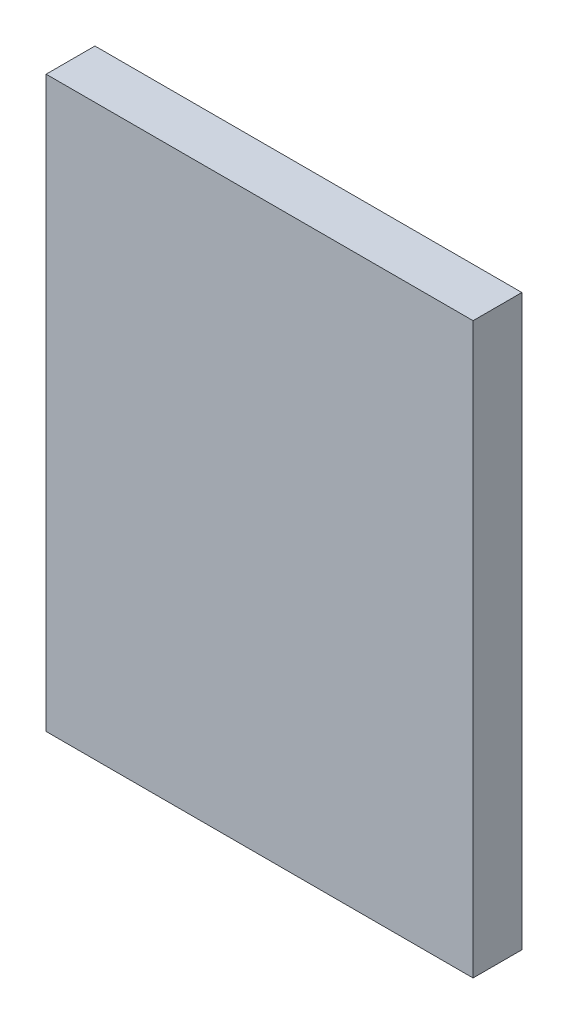
ISO-10303-21;
HEADER;
FILE_DESCRIPTION(('STEP AP214'),'2;1');
FILE_NAME('part.step','',(''),(''),'','','');
FILE_SCHEMA(('AUTOMOTIVE_DESIGN { 1 0 10303 214 1 1 1 1 }'));
ENDSEC;
DATA;
#1=APPLICATION_CONTEXT('core data for automotive mechanical design processes');
#2=APPLICATION_PROTOCOL_DEFINITION('international standard','automotive_design',2000,#1);
#3=PRODUCT_CONTEXT('',#1,'mechanical');
#4=PRODUCT('Part','Part','',(#3));
#5=PRODUCT_RELATED_PRODUCT_CATEGORY('part','',(#4));
#6=PRODUCT_DEFINITION_FORMATION('','',#4);
#7=PRODUCT_DEFINITION_CONTEXT('part definition',#1,'design');
#8=PRODUCT_DEFINITION('design','',#6,#7);
#9=PRODUCT_DEFINITION_SHAPE('','',#8);
#10=(LENGTH_UNIT() NAMED_UNIT(*) SI_UNIT(.MILLI.,.METRE.));
#11=(NAMED_UNIT(*) PLANE_ANGLE_UNIT() SI_UNIT($,.RADIAN.));
#12=(NAMED_UNIT(*) SI_UNIT($,.STERADIAN.) SOLID_ANGLE_UNIT());
#13=UNCERTAINTY_MEASURE_WITH_UNIT(LENGTH_MEASURE(1.E-05),#10,'distance_accuracy_value','');
#14=(GEOMETRIC_REPRESENTATION_CONTEXT(3) GLOBAL_UNCERTAINTY_ASSIGNED_CONTEXT((#13)) GLOBAL_UNIT_ASSIGNED_CONTEXT((#10,
#11,#12)) REPRESENTATION_CONTEXT('',''));
#15=CARTESIAN_POINT('',(0.,0.,0.));
#16=DIRECTION('',(0.,0.,1.));
#17=DIRECTION('',(1.,0.,0.));
#18=AXIS2_PLACEMENT_3D('',#15,#16,#17);
#19=CARTESIAN_POINT('',(7.695,2.8829,0.76487));
#20=DIRECTION('',(0.,0.,-1.));
#21=DIRECTION('',(-1.,0.,0.));
#22=AXIS2_PLACEMENT_3D('',#19,#20,#21);
#23=PLANE('',#22);
#24=DIRECTION('',(1.,0.,0.));
#25=VECTOR('',#24,1.);
#26=CARTESIAN_POINT('',(7.545,3.0829,0.76487));
#27=LINE('',#26,#25);
#28=CARTESIAN_POINT('',(7.545,3.0829,0.76487));
#29=VERTEX_POINT('',#28);
#30=CARTESIAN_POINT('',(7.845,3.0829,0.76487));
#31=VERTEX_POINT('',#30);
#32=EDGE_CURVE('E55',#29,#31,#27,.T.);
#33=ORIENTED_EDGE('',*,*,#32,.T.);
#34=DIRECTION('',(0.,1.,0.));
#35=VECTOR('',#34,1.);
#36=CARTESIAN_POINT('',(7.845,3.0829,0.76487));
#37=LINE('',#36,#35);
#38=CARTESIAN_POINT('',(7.845,2.6829,0.76487));
#39=VERTEX_POINT('',#38);
#40=EDGE_CURVE('E57',#31,#39,#37,.F.);
#41=ORIENTED_EDGE('',*,*,#40,.T.);
#42=DIRECTION('',(1.,0.,0.));
#43=VECTOR('',#42,1.);
#44=CARTESIAN_POINT('',(7.845,2.6829,0.76487));
#45=LINE('',#44,#43);
#46=CARTESIAN_POINT('',(7.545,2.6829,0.76487));
#47=VERTEX_POINT('',#46);
#48=EDGE_CURVE('E20',#39,#47,#45,.F.);
#49=ORIENTED_EDGE('',*,*,#48,.T.);
#50=DIRECTION('',(0.,1.,0.));
#51=VECTOR('',#50,1.);
#52=CARTESIAN_POINT('',(7.545,2.6829,0.76487));
#53=LINE('',#52,#51);
#54=EDGE_CURVE('E80',#47,#29,#53,.T.);
#55=ORIENTED_EDGE('',*,*,#54,.T.);
#56=EDGE_LOOP('',(#33,#41,#49,#55));
#57=FACE_BOUND('',#56,.T.);
#58=ADVANCED_FACE('F17',(#57),#23,.T.);
#59=CARTESIAN_POINT('',(7.845,2.6829,0.76487));
#60=DIRECTION('',(0.,1.,0.));
#61=DIRECTION('',(0.,0.,1.));
#62=AXIS2_PLACEMENT_3D('',#59,#60,#61);
#63=PLANE('',#62);
#64=DIRECTION('',(0.,0.,-1.));
#65=VECTOR('',#64,1.);
#66=CARTESIAN_POINT('',(7.545,2.6829,0.76487));
#67=LINE('',#66,#65);
#68=CARTESIAN_POINT('',(7.545,2.6829,0.79916));
#69=VERTEX_POINT('',#68);
#70=EDGE_CURVE('E68',#69,#47,#67,.T.);
#71=ORIENTED_EDGE('',*,*,#70,.T.);
#72=ORIENTED_EDGE('',*,*,#48,.F.);
#73=DIRECTION('',(0.,0.,1.));
#74=VECTOR('',#73,1.);
#75=CARTESIAN_POINT('',(7.845,2.6829,0.76487));
#76=LINE('',#75,#74);
#77=CARTESIAN_POINT('',(7.845,2.6829,0.79916));
#78=VERTEX_POINT('',#77);
#79=EDGE_CURVE('E63',#39,#78,#76,.T.);
#80=ORIENTED_EDGE('',*,*,#79,.T.);
#81=DIRECTION('',(1.,0.,0.));
#82=VECTOR('',#81,1.);
#83=CARTESIAN_POINT('',(7.695,2.6829,0.79916));
#84=LINE('',#83,#82);
#85=EDGE_CURVE('E83',#69,#78,#84,.T.);
#86=ORIENTED_EDGE('',*,*,#85,.F.);
#87=EDGE_LOOP('',(#71,#72,#80,#86));
#88=FACE_BOUND('',#87,.T.);
#89=ADVANCED_FACE('F65',(#88),#63,.F.);
#90=CARTESIAN_POINT('',(7.845,3.0829,0.76487));
#91=DIRECTION('',(-1.,0.,0.));
#92=DIRECTION('',(0.,0.,1.));
#93=AXIS2_PLACEMENT_3D('',#90,#91,#92);
#94=PLANE('',#93);
#95=ORIENTED_EDGE('',*,*,#79,.F.);
#96=ORIENTED_EDGE('',*,*,#40,.F.);
#97=DIRECTION('',(0.,0.,-1.));
#98=VECTOR('',#97,1.);
#99=CARTESIAN_POINT('',(7.845,3.0829,0.76487));
#100=LINE('',#99,#98);
#101=CARTESIAN_POINT('',(7.845,3.0829,0.79916));
#102=VERTEX_POINT('',#101);
#103=EDGE_CURVE('E75',#31,#102,#100,.F.);
#104=ORIENTED_EDGE('',*,*,#103,.T.);
#105=DIRECTION('',(0.,-1.,0.));
#106=VECTOR('',#105,1.);
#107=CARTESIAN_POINT('',(7.845,2.8829,0.79916));
#108=LINE('',#107,#106);
#109=EDGE_CURVE('E72',#78,#102,#108,.F.);
#110=ORIENTED_EDGE('',*,*,#109,.F.);
#111=EDGE_LOOP('',(#95,#96,#104,#110));
#112=FACE_BOUND('',#111,.T.);
#113=ADVANCED_FACE('F70',(#112),#94,.F.);
#114=CARTESIAN_POINT('',(7.545,3.0829,0.76487));
#115=DIRECTION('',(0.,-1.,0.));
#116=DIRECTION('',(0.,0.,-1.));
#117=AXIS2_PLACEMENT_3D('',#114,#115,#116);
#118=PLANE('',#117);
#119=ORIENTED_EDGE('',*,*,#103,.F.);
#120=ORIENTED_EDGE('',*,*,#32,.F.);
#121=DIRECTION('',(0.,0.,-1.));
#122=VECTOR('',#121,1.);
#123=CARTESIAN_POINT('',(7.545,3.0829,0.76487));
#124=LINE('',#123,#122);
#125=CARTESIAN_POINT('',(7.545,3.0829,0.79916));
#126=VERTEX_POINT('',#125);
#127=EDGE_CURVE('E35',#29,#126,#124,.F.);
#128=ORIENTED_EDGE('',*,*,#127,.T.);
#129=DIRECTION('',(1.,0.,0.));
#130=VECTOR('',#129,1.);
#131=CARTESIAN_POINT('',(7.695,3.0829,0.79916));
#132=LINE('',#131,#130);
#133=EDGE_CURVE('E26',#102,#126,#132,.F.);
#134=ORIENTED_EDGE('',*,*,#133,.F.);
#135=EDGE_LOOP('',(#119,#120,#128,#134));
#136=FACE_BOUND('',#135,.T.);
#137=ADVANCED_FACE('F89',(#136),#118,.F.);
#138=CARTESIAN_POINT('',(7.545,2.6829,0.76487));
#139=DIRECTION('',(1.,0.,0.));
#140=DIRECTION('',(0.,0.,-1.));
#141=AXIS2_PLACEMENT_3D('',#138,#139,#140);
#142=PLANE('',#141);
#143=ORIENTED_EDGE('',*,*,#127,.F.);
#144=ORIENTED_EDGE('',*,*,#54,.F.);
#145=ORIENTED_EDGE('',*,*,#70,.F.);
#146=DIRECTION('',(0.,-1.,0.));
#147=VECTOR('',#146,1.);
#148=CARTESIAN_POINT('',(7.545,2.8829,0.79916));
#149=LINE('',#148,#147);
#150=EDGE_CURVE('E11',#126,#69,#149,.T.);
#151=ORIENTED_EDGE('',*,*,#150,.F.);
#152=EDGE_LOOP('',(#143,#144,#145,#151));
#153=FACE_BOUND('',#152,.T.);
#154=ADVANCED_FACE('F91',(#153),#142,.F.);
#155=CARTESIAN_POINT('',(7.695,2.8829,0.79916));
#156=DIRECTION('',(0.,0.,1.));
#157=DIRECTION('',(0.,-1.,0.));
#158=AXIS2_PLACEMENT_3D('',#155,#156,#157);
#159=PLANE('',#158);
#160=ORIENTED_EDGE('',*,*,#133,.T.);
#161=ORIENTED_EDGE('',*,*,#150,.T.);
#162=ORIENTED_EDGE('',*,*,#85,.T.);
#163=ORIENTED_EDGE('',*,*,#109,.T.);
#164=EDGE_LOOP('',(#160,#161,#162,#163));
#165=FACE_BOUND('',#164,.T.);
#166=ADVANCED_FACE('F88',(#165),#159,.T.);
#167=CLOSED_SHELL('',(#58,#89,#113,#137,#154,#166));
#168=MANIFOLD_SOLID_BREP('B1',#167);
#169=ADVANCED_BREP_SHAPE_REPRESENTATION('',(#18,#168),#14);
#170=SHAPE_DEFINITION_REPRESENTATION(#9,#169);
ENDSEC;
END-ISO-10303-21;
